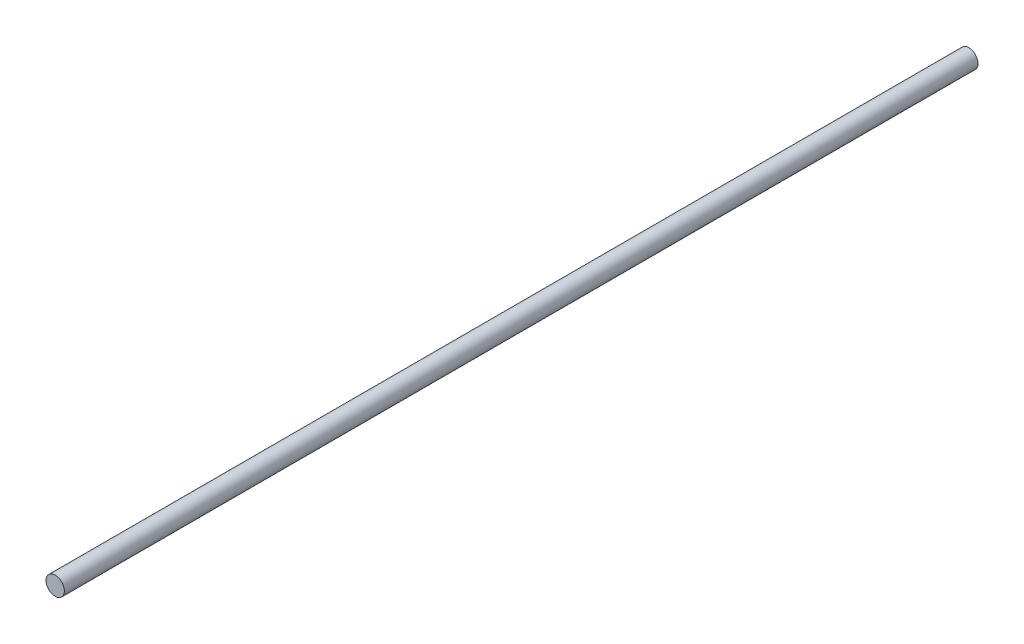
ISO-10303-21;
HEADER;
FILE_DESCRIPTION(('STEP AP214'),'2;1');
FILE_NAME('part.step','',(''),(''),'','','');
FILE_SCHEMA(('AUTOMOTIVE_DESIGN { 1 0 10303 214 1 1 1 1 }'));
ENDSEC;
DATA;
#1=APPLICATION_CONTEXT('core data for automotive mechanical design processes');
#2=APPLICATION_PROTOCOL_DEFINITION('international standard','automotive_design',2000,#1);
#3=PRODUCT_CONTEXT('',#1,'mechanical');
#4=PRODUCT('Part','Part','',(#3));
#5=PRODUCT_RELATED_PRODUCT_CATEGORY('part','',(#4));
#6=PRODUCT_DEFINITION_FORMATION('','',#4);
#7=PRODUCT_DEFINITION_CONTEXT('part definition',#1,'design');
#8=PRODUCT_DEFINITION('design','',#6,#7);
#9=PRODUCT_DEFINITION_SHAPE('','',#8);
#10=(LENGTH_UNIT() NAMED_UNIT(*) SI_UNIT(.MILLI.,.METRE.));
#11=(NAMED_UNIT(*) PLANE_ANGLE_UNIT() SI_UNIT($,.RADIAN.));
#12=(NAMED_UNIT(*) SI_UNIT($,.STERADIAN.) SOLID_ANGLE_UNIT());
#13=UNCERTAINTY_MEASURE_WITH_UNIT(LENGTH_MEASURE(1.E-05),#10,'distance_accuracy_value','');
#14=(GEOMETRIC_REPRESENTATION_CONTEXT(3) GLOBAL_UNCERTAINTY_ASSIGNED_CONTEXT((#13)) GLOBAL_UNIT_ASSIGNED_CONTEXT((#10,
#11,#12)) REPRESENTATION_CONTEXT('',''));
#15=CARTESIAN_POINT('',(0.,0.,0.));
#16=DIRECTION('',(0.,0.,1.));
#17=DIRECTION('',(1.,0.,0.));
#18=AXIS2_PLACEMENT_3D('',#15,#16,#17);
#19=CARTESIAN_POINT('',(0.,0.,7.80000019073498));
#20=DIRECTION('',(0.,0.,-1.));
#21=DIRECTION('',(0.,1.,0.));
#22=AXIS2_PLACEMENT_3D('',#19,#20,#21);
#23=PLANE('',#22);
#24=CARTESIAN_POINT('',(0.,0.,7.80000019073498));
#25=DIRECTION('',(0.,0.,1.));
#26=DIRECTION('',(0.,-1.,0.));
#27=AXIS2_PLACEMENT_3D('',#24,#25,#26);
#28=CIRCLE('',#27,4.00000000000001);
#29=CARTESIAN_POINT('',(0.,-4.00000000000001,7.80000019073498));
#30=VERTEX_POINT('',#29);
#31=EDGE_CURVE('E10',#30,#30,#28,.T.);
#32=ORIENTED_EDGE('',*,*,#31,.T.);
#33=EDGE_LOOP('',(#32));
#34=FACE_BOUND('',#33,.T.);
#35=ADVANCED_FACE('F33',(#34),#23,.F.);
#36=CARTESIAN_POINT('',(0.,0.,7.80000019073498));
#37=DIRECTION('',(0.,0.,1.));
#38=DIRECTION('',(0.,-1.,0.));
#39=AXIS2_PLACEMENT_3D('',#36,#37,#38);
#40=CYLINDRICAL_SURFACE('',#39,3.99999999999985);
#41=ORIENTED_EDGE('',*,*,#31,.F.);
#42=EDGE_LOOP('',(#41));
#43=FACE_BOUND('',#42,.T.);
#44=CARTESIAN_POINT('',(0.,3.03579087218282E-13,-390.003194168601));
#45=DIRECTION('',(0.,0.,1.));
#46=DIRECTION('',(0.,-1.,0.));
#47=AXIS2_PLACEMENT_3D('',#44,#45,#46);
#48=CIRCLE('',#47,3.9999999999997);
#49=CARTESIAN_POINT('',(0.,-3.99999999999939,-390.003194168601));
#50=VERTEX_POINT('',#49);
#51=EDGE_CURVE('E39',#50,#50,#48,.T.);
#52=ORIENTED_EDGE('',*,*,#51,.T.);
#53=EDGE_LOOP('',(#52));
#54=FACE_BOUND('',#53,.T.);
#55=ADVANCED_FACE('F45',(#43,#54),#40,.T.);
#56=CARTESIAN_POINT('',(0.,-1.44849410244063E-13,-390.003194168601));
#57=DIRECTION('',(0.,0.,1.));
#58=DIRECTION('',(0.,-1.,0.));
#59=AXIS2_PLACEMENT_3D('',#56,#57,#58);
#60=PLANE('',#59);
#61=ORIENTED_EDGE('',*,*,#51,.F.);
#62=EDGE_LOOP('',(#61));
#63=FACE_BOUND('',#62,.T.);
#64=ADVANCED_FACE('F47',(#63),#60,.F.);
#65=CLOSED_SHELL('',(#35,#55,#64));
#66=MANIFOLD_SOLID_BREP('B2',#65);
#67=ADVANCED_BREP_SHAPE_REPRESENTATION('',(#18,#66),#14);
#68=SHAPE_DEFINITION_REPRESENTATION(#9,#67);
ENDSEC;
END-ISO-10303-21;
